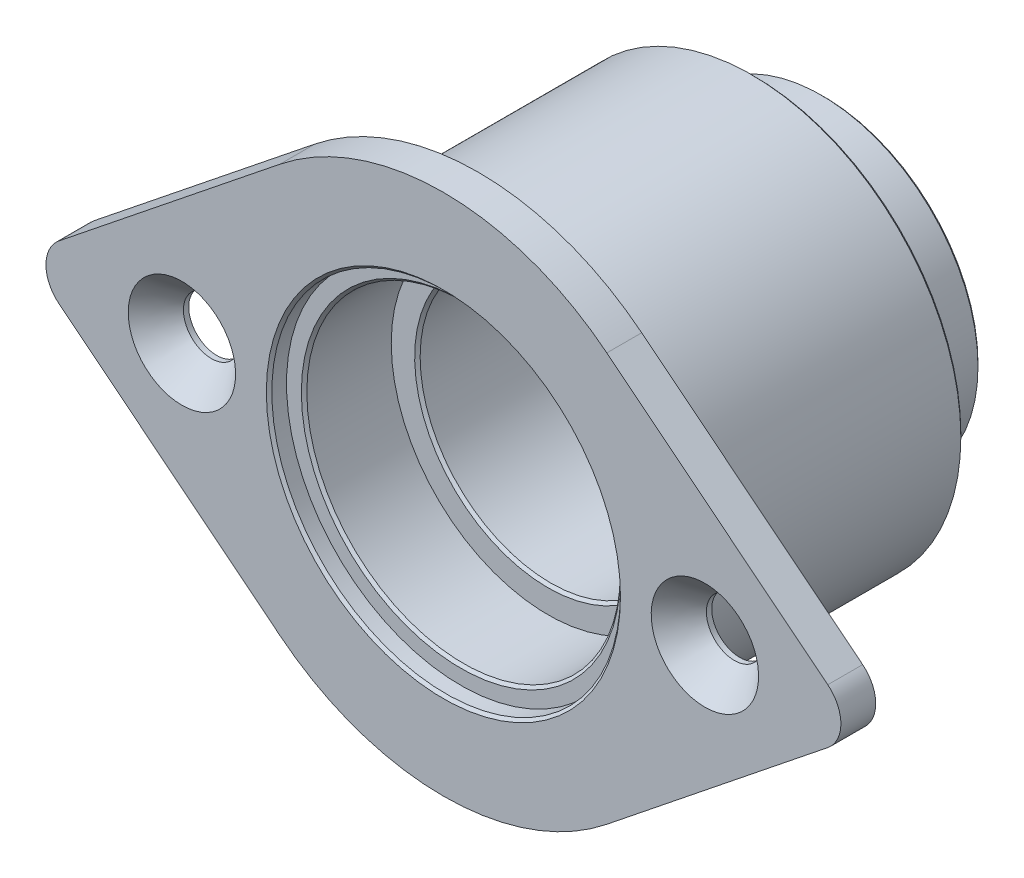
ISO-10303-21;
HEADER;
FILE_DESCRIPTION(('STEP AP214'),'2;1');
FILE_NAME('part.step','',(''),(''),'','','');
FILE_SCHEMA(('AUTOMOTIVE_DESIGN { 1 0 10303 214 1 1 1 1 }'));
ENDSEC;
DATA;
#1=APPLICATION_CONTEXT('core data for automotive mechanical design processes');
#2=APPLICATION_PROTOCOL_DEFINITION('international standard','automotive_design',2000,#1);
#3=PRODUCT_CONTEXT('',#1,'mechanical');
#4=PRODUCT('Part','Part','',(#3));
#5=PRODUCT_RELATED_PRODUCT_CATEGORY('part','',(#4));
#6=PRODUCT_DEFINITION_FORMATION('','',#4);
#7=PRODUCT_DEFINITION_CONTEXT('part definition',#1,'design');
#8=PRODUCT_DEFINITION('design','',#6,#7);
#9=PRODUCT_DEFINITION_SHAPE('','',#8);
#10=(LENGTH_UNIT() NAMED_UNIT(*) SI_UNIT(.MILLI.,.METRE.));
#11=(NAMED_UNIT(*) PLANE_ANGLE_UNIT() SI_UNIT($,.RADIAN.));
#12=(NAMED_UNIT(*) SI_UNIT($,.STERADIAN.) SOLID_ANGLE_UNIT());
#13=UNCERTAINTY_MEASURE_WITH_UNIT(LENGTH_MEASURE(1.E-05),#10,'distance_accuracy_value','');
#14=(GEOMETRIC_REPRESENTATION_CONTEXT(3) GLOBAL_UNCERTAINTY_ASSIGNED_CONTEXT((#13)) GLOBAL_UNIT_ASSIGNED_CONTEXT((#10,
#11,#12)) REPRESENTATION_CONTEXT('',''));
#15=CARTESIAN_POINT('',(0.,0.,0.));
#16=DIRECTION('',(0.,0.,1.));
#17=DIRECTION('',(1.,0.,0.));
#18=AXIS2_PLACEMENT_3D('',#15,#16,#17);
#19=CARTESIAN_POINT('',(0.,0.,-7.9375));
#20=DIRECTION('',(0.,0.,1.));
#21=DIRECTION('',(1.,0.,0.));
#22=AXIS2_PLACEMENT_3D('',#19,#20,#21);
#23=PLANE('',#22);
#24=CARTESIAN_POINT('',(0.,0.,-7.9375));
#25=DIRECTION('',(0.,0.,-1.));
#26=DIRECTION('',(-1.,0.,0.));
#27=AXIS2_PLACEMENT_3D('',#24,#25,#26);
#28=CIRCLE('',#27,14.2748);
#29=CARTESIAN_POINT('',(-14.2748,0.,-7.9375));
#30=VERTEX_POINT('',#29);
#31=EDGE_CURVE('E135',#30,#30,#28,.F.);
#32=ORIENTED_EDGE('',*,*,#31,.T.);
#33=EDGE_LOOP('',(#32));
#34=FACE_BOUND('',#33,.T.);
#35=CARTESIAN_POINT('',(0.,0.,-7.9375));
#36=DIRECTION('',(0.,0.,1.));
#37=DIRECTION('',(0.,-1.,0.));
#38=AXIS2_PLACEMENT_3D('',#35,#36,#37);
#39=CIRCLE('',#38,12.1435499999999);
#40=CARTESIAN_POINT('',(0.,-12.1435499999999,-7.9375));
#41=VERTEX_POINT('',#40);
#42=EDGE_CURVE('E19',#41,#41,#39,.F.);
#43=ORIENTED_EDGE('',*,*,#42,.T.);
#44=EDGE_LOOP('',(#43));
#45=FACE_BOUND('',#44,.T.);
#46=ADVANCED_FACE('F16',(#34,#45),#23,.T.);
#47=CARTESIAN_POINT('',(0.,0.,-7.9375));
#48=DIRECTION('',(0.,0.,1.));
#49=DIRECTION('',(0.,-1.,0.));
#50=AXIS2_PLACEMENT_3D('',#47,#48,#49);
#51=CONICAL_SURFACE('',#50,12.1435499999999,0.785398163397434);
#52=CARTESIAN_POINT('',(0.,0.,-8.18749999999995));
#53=DIRECTION('',(0.,0.,-1.));
#54=DIRECTION('',(-1.,0.,0.));
#55=AXIS2_PLACEMENT_3D('',#52,#53,#54);
#56=CIRCLE('',#55,11.89355);
#57=CARTESIAN_POINT('',(-11.89355,0.,-8.18749999999995));
#58=VERTEX_POINT('',#57);
#59=EDGE_CURVE('E133',#58,#58,#56,.T.);
#60=ORIENTED_EDGE('',*,*,#59,.T.);
#61=EDGE_LOOP('',(#60));
#62=FACE_BOUND('',#61,.T.);
#63=ORIENTED_EDGE('',*,*,#42,.F.);
#64=EDGE_LOOP('',(#63));
#65=FACE_BOUND('',#64,.T.);
#66=ADVANCED_FACE('F194',(#62,#65),#51,.F.);
#67=CARTESIAN_POINT('',(0.,0.,1.5875));
#68=DIRECTION('',(0.,0.,-1.));
#69=DIRECTION('',(-1.,0.,0.));
#70=AXIS2_PLACEMENT_3D('',#67,#68,#69);
#71=CYLINDRICAL_SURFACE('',#70,14.2748);
#72=CARTESIAN_POINT('',(0.,0.,-0.249999999999985));
#73=DIRECTION('',(0.,0.,1.));
#74=DIRECTION('',(1.,0.,0.));
#75=AXIS2_PLACEMENT_3D('',#72,#73,#74);
#76=CIRCLE('',#75,14.2748);
#77=CARTESIAN_POINT('',(14.2748,0.,-0.249999999999985));
#78=VERTEX_POINT('',#77);
#79=EDGE_CURVE('E130',#78,#78,#76,.T.);
#80=ORIENTED_EDGE('',*,*,#79,.T.);
#81=EDGE_LOOP('',(#80));
#82=FACE_BOUND('',#81,.T.);
#83=ORIENTED_EDGE('',*,*,#31,.F.);
#84=EDGE_LOOP('',(#83));
#85=FACE_BOUND('',#84,.T.);
#86=ADVANCED_FACE('F196',(#82,#85),#71,.F.);
#87=CARTESIAN_POINT('',(0.,0.,38.7877315203269));
#88=DIRECTION('',(0.,0.,-1.));
#89=DIRECTION('',(-1.,0.,0.));
#90=AXIS2_PLACEMENT_3D('',#87,#88,#89);
#91=CYLINDRICAL_SURFACE('',#90,11.89355);
#92=ORIENTED_EDGE('',*,*,#59,.F.);
#93=EDGE_LOOP('',(#92));
#94=FACE_BOUND('',#93,.T.);
#95=CARTESIAN_POINT('',(0.,0.,-32.8334999999999));
#96=DIRECTION('',(0.,0.,-1.));
#97=DIRECTION('',(-1.,0.,0.));
#98=AXIS2_PLACEMENT_3D('',#95,#96,#97);
#99=CIRCLE('',#98,11.89355);
#100=CARTESIAN_POINT('',(-11.89355,0.,-32.8334999999999));
#101=VERTEX_POINT('',#100);
#102=EDGE_CURVE('E126',#101,#101,#99,.T.);
#103=ORIENTED_EDGE('',*,*,#102,.T.);
#104=EDGE_LOOP('',(#103));
#105=FACE_BOUND('',#104,.T.);
#106=ADVANCED_FACE('F203',(#94,#105),#91,.F.);
#107=CARTESIAN_POINT('',(0.,0.,0.));
#108=DIRECTION('',(0.,0.,1.));
#109=DIRECTION('',(1.,0.,0.));
#110=AXIS2_PLACEMENT_3D('',#107,#108,#109);
#111=CONICAL_SURFACE('',#110,14.5248,0.785398163397459);
#112=ORIENTED_EDGE('',*,*,#79,.F.);
#113=EDGE_LOOP('',(#112));
#114=FACE_BOUND('',#113,.T.);
#115=CARTESIAN_POINT('',(0.,0.,0.));
#116=DIRECTION('',(0.,0.,1.));
#117=DIRECTION('',(1.,0.,0.));
#118=AXIS2_PLACEMENT_3D('',#115,#116,#117);
#119=CIRCLE('',#118,14.5248);
#120=CARTESIAN_POINT('',(14.5248,0.,0.));
#121=VERTEX_POINT('',#120);
#122=EDGE_CURVE('E129',#121,#121,#119,.F.);
#123=ORIENTED_EDGE('',*,*,#122,.F.);
#124=EDGE_LOOP('',(#123));
#125=FACE_BOUND('',#124,.T.);
#126=ADVANCED_FACE('F299',(#114,#125),#111,.F.);
#127=CARTESIAN_POINT('',(0.,0.,-33.0835));
#128=DIRECTION('',(0.,0.,-1.));
#129=DIRECTION('',(0.,1.,0.));
#130=AXIS2_PLACEMENT_3D('',#127,#128,#129);
#131=CONICAL_SURFACE('',#130,12.1435500000001,0.785398163397448);
#132=ORIENTED_EDGE('',*,*,#102,.F.);
#133=EDGE_LOOP('',(#132));
#134=FACE_BOUND('',#133,.T.);
#135=CARTESIAN_POINT('',(0.,0.,-33.0835));
#136=DIRECTION('',(0.,0.,-1.));
#137=DIRECTION('',(0.,1.,0.));
#138=AXIS2_PLACEMENT_3D('',#135,#136,#137);
#139=CIRCLE('',#138,12.1435500000001);
#140=CARTESIAN_POINT('',(0.,12.1435500000001,-33.0835));
#141=VERTEX_POINT('',#140);
#142=EDGE_CURVE('E183',#141,#141,#139,.F.);
#143=ORIENTED_EDGE('',*,*,#142,.F.);
#144=EDGE_LOOP('',(#143));
#145=FACE_BOUND('',#144,.T.);
#146=ADVANCED_FACE('F295',(#134,#145),#131,.F.);
#147=CARTESIAN_POINT('',(0.,0.,0.));
#148=DIRECTION('',(0.,0.,1.));
#149=DIRECTION('',(1.,0.,0.));
#150=AXIS2_PLACEMENT_3D('',#147,#148,#149);
#151=PLANE('',#150);
#152=CARTESIAN_POINT('',(0.,0.,0.));
#153=DIRECTION('',(0.,0.,1.));
#154=DIRECTION('',(1.,0.,0.));
#155=AXIS2_PLACEMENT_3D('',#152,#153,#154);
#156=CIRCLE('',#155,15.875);
#157=CARTESIAN_POINT('',(15.875,0.,0.));
#158=VERTEX_POINT('',#157);
#159=EDGE_CURVE('E180',#158,#158,#156,.T.);
#160=ORIENTED_EDGE('',*,*,#159,.T.);
#161=EDGE_LOOP('',(#160));
#162=FACE_BOUND('',#161,.T.);
#163=ORIENTED_EDGE('',*,*,#122,.T.);
#164=EDGE_LOOP('',(#163));
#165=FACE_BOUND('',#164,.T.);
#166=ADVANCED_FACE('F291',(#162,#165),#151,.T.);
#167=CARTESIAN_POINT('',(0.,0.,-33.0835));
#168=DIRECTION('',(0.,0.,-1.));
#169=DIRECTION('',(-1.,0.,0.));
#170=AXIS2_PLACEMENT_3D('',#167,#168,#169);
#171=PLANE('',#170);
#172=ORIENTED_EDGE('',*,*,#142,.T.);
#173=EDGE_LOOP('',(#172));
#174=FACE_BOUND('',#173,.T.);
#175=CARTESIAN_POINT('',(0.,0.,-33.0835));
#176=DIRECTION('',(0.,0.,1.));
#177=DIRECTION('',(1.,0.,0.));
#178=AXIS2_PLACEMENT_3D('',#175,#176,#177);
#179=CIRCLE('',#178,14.0121);
#180=CARTESIAN_POINT('',(14.0121,0.,-33.0835));
#181=VERTEX_POINT('',#180);
#182=EDGE_CURVE('E125',#181,#181,#179,.T.);
#183=ORIENTED_EDGE('',*,*,#182,.F.);
#184=EDGE_LOOP('',(#183));
#185=FACE_BOUND('',#184,.T.);
#186=ADVANCED_FACE('F287',(#174,#185),#171,.T.);
#187=CARTESIAN_POINT('',(0.,0.,0.));
#188=DIRECTION('',(0.,0.,1.));
#189=DIRECTION('',(1.,0.,0.));
#190=AXIS2_PLACEMENT_3D('',#187,#188,#189);
#191=CYLINDRICAL_SURFACE('',#190,15.875);
#192=ORIENTED_EDGE('',*,*,#159,.F.);
#193=EDGE_LOOP('',(#192));
#194=FACE_BOUND('',#193,.T.);
#195=CARTESIAN_POINT('',(0.,0.,1.3375));
#196=DIRECTION('',(0.,0.,1.));
#197=DIRECTION('',(1.,0.,0.));
#198=AXIS2_PLACEMENT_3D('',#195,#196,#197);
#199=CIRCLE('',#198,15.875);
#200=CARTESIAN_POINT('',(15.875,0.,1.3375));
#201=VERTEX_POINT('',#200);
#202=EDGE_CURVE('E122',#201,#201,#199,.T.);
#203=ORIENTED_EDGE('',*,*,#202,.T.);
#204=EDGE_LOOP('',(#203));
#205=FACE_BOUND('',#204,.T.);
#206=ADVANCED_FACE('F283',(#194,#205),#191,.F.);
#207=CARTESIAN_POINT('',(0.,0.,-32.8335));
#208=DIRECTION('',(0.,0.,1.));
#209=DIRECTION('',(1.,0.,0.));
#210=AXIS2_PLACEMENT_3D('',#207,#208,#209);
#211=CONICAL_SURFACE('',#210,14.2621,0.785398163397424);
#212=CARTESIAN_POINT('',(0.,0.,-32.8335));
#213=DIRECTION('',(0.,0.,-1.));
#214=DIRECTION('',(-1.,0.,0.));
#215=AXIS2_PLACEMENT_3D('',#212,#213,#214);
#216=CIRCLE('',#215,14.2621);
#217=CARTESIAN_POINT('',(-14.2621,0.,-32.8335));
#218=VERTEX_POINT('',#217);
#219=EDGE_CURVE('E118',#218,#218,#216,.F.);
#220=ORIENTED_EDGE('',*,*,#219,.F.);
#221=EDGE_LOOP('',(#220));
#222=FACE_BOUND('',#221,.T.);
#223=ORIENTED_EDGE('',*,*,#182,.T.);
#224=EDGE_LOOP('',(#223));
#225=FACE_BOUND('',#224,.T.);
#226=ADVANCED_FACE('F279',(#222,#225),#211,.T.);
#227=CARTESIAN_POINT('',(0.,0.,1.5875));
#228=DIRECTION('',(0.,0.,1.));
#229=DIRECTION('',(1.,0.,0.));
#230=AXIS2_PLACEMENT_3D('',#227,#228,#229);
#231=CONICAL_SURFACE('',#230,16.125,0.785398163397476);
#232=ORIENTED_EDGE('',*,*,#202,.F.);
#233=EDGE_LOOP('',(#232));
#234=FACE_BOUND('',#233,.T.);
#235=CARTESIAN_POINT('',(0.,0.,1.5875));
#236=DIRECTION('',(0.,0.,1.));
#237=DIRECTION('',(1.,0.,0.));
#238=AXIS2_PLACEMENT_3D('',#235,#236,#237);
#239=CIRCLE('',#238,16.125);
#240=CARTESIAN_POINT('',(16.125,0.,1.5875));
#241=VERTEX_POINT('',#240);
#242=EDGE_CURVE('E121',#241,#241,#239,.F.);
#243=ORIENTED_EDGE('',*,*,#242,.F.);
#244=EDGE_LOOP('',(#243));
#245=FACE_BOUND('',#244,.T.);
#246=ADVANCED_FACE('F275',(#234,#245),#231,.F.);
#247=CARTESIAN_POINT('',(0.,0.,27.1480367264149));
#248=DIRECTION('',(0.,0.,-1.));
#249=DIRECTION('',(-1.,0.,0.));
#250=AXIS2_PLACEMENT_3D('',#247,#248,#249);
#251=CYLINDRICAL_SURFACE('',#250,14.2621);
#252=ORIENTED_EDGE('',*,*,#219,.T.);
#253=EDGE_LOOP('',(#252));
#254=FACE_BOUND('',#253,.T.);
#255=CARTESIAN_POINT('',(0.,0.,-26.7335));
#256=DIRECTION('',(0.,0.,-1.));
#257=DIRECTION('',(-1.,0.,0.));
#258=AXIS2_PLACEMENT_3D('',#255,#256,#257);
#259=CIRCLE('',#258,14.2621);
#260=CARTESIAN_POINT('',(-14.2621,0.,-26.7335));
#261=VERTEX_POINT('',#260);
#262=EDGE_CURVE('E117',#261,#261,#259,.F.);
#263=ORIENTED_EDGE('',*,*,#262,.F.);
#264=EDGE_LOOP('',(#263));
#265=FACE_BOUND('',#264,.T.);
#266=ADVANCED_FACE('F271',(#254,#265),#251,.T.);
#267=CARTESIAN_POINT('',(-23.8125,0.,1.58749999997099));
#268=DIRECTION('',(0.,0.,1.));
#269=DIRECTION('',(0.,-1.,0.));
#270=AXIS2_PLACEMENT_3D('',#267,#268,#269);
#271=CONICAL_SURFACE('',#270,4.88949999997067,0.71558499333661);
#272=CARTESIAN_POINT('',(-23.8125,0.,-1.10068089399406));
#273=DIRECTION('',(0.,0.,1.));
#274=DIRECTION('',(1.,0.,0.));
#275=AXIS2_PLACEMENT_3D('',#272,#273,#274);
#276=CIRCLE('',#275,2.5527);
#277=CARTESIAN_POINT('',(-21.2598,0.,-1.10068089399406));
#278=VERTEX_POINT('',#277);
#279=EDGE_CURVE('E114',#278,#278,#276,.F.);
#280=ORIENTED_EDGE('',*,*,#279,.T.);
#281=EDGE_LOOP('',(#280));
#282=FACE_BOUND('',#281,.T.);
#283=CARTESIAN_POINT('',(-23.8125,0.,1.58749999997099));
#284=DIRECTION('',(0.,0.,1.));
#285=DIRECTION('',(0.,-1.,0.));
#286=AXIS2_PLACEMENT_3D('',#283,#284,#285);
#287=CIRCLE('',#286,4.88949999997067);
#288=CARTESIAN_POINT('',(-23.8125,-4.88949999997067,1.58749999997099));
#289=VERTEX_POINT('',#288);
#290=EDGE_CURVE('E173',#289,#289,#287,.F.);
#291=ORIENTED_EDGE('',*,*,#290,.F.);
#292=EDGE_LOOP('',(#291));
#293=FACE_BOUND('',#292,.T.);
#294=ADVANCED_FACE('F267',(#282,#293),#271,.F.);
#295=CARTESIAN_POINT('',(23.8125,0.,1.58749999997099));
#296=DIRECTION('',(0.,0.,1.));
#297=DIRECTION('',(0.,-1.,0.));
#298=AXIS2_PLACEMENT_3D('',#295,#296,#297);
#299=CONICAL_SURFACE('',#298,4.88949999995293,0.71558499333661);
#300=CARTESIAN_POINT('',(23.8125,0.,-1.10068089399406));
#301=DIRECTION('',(0.,0.,1.));
#302=DIRECTION('',(1.,0.,0.));
#303=AXIS2_PLACEMENT_3D('',#300,#301,#302);
#304=CIRCLE('',#303,2.5527);
#305=CARTESIAN_POINT('',(26.3652,0.,-1.10068089399406));
#306=VERTEX_POINT('',#305);
#307=EDGE_CURVE('E92',#306,#306,#304,.F.);
#308=ORIENTED_EDGE('',*,*,#307,.T.);
#309=EDGE_LOOP('',(#308));
#310=FACE_BOUND('',#309,.T.);
#311=CARTESIAN_POINT('',(23.8125,0.,1.58749999997099));
#312=DIRECTION('',(0.,0.,1.));
#313=DIRECTION('',(0.,-1.,0.));
#314=AXIS2_PLACEMENT_3D('',#311,#312,#313);
#315=CIRCLE('',#314,4.88949999995293);
#316=CARTESIAN_POINT('',(23.8125,-4.88949999995292,1.58749999997099));
#317=VERTEX_POINT('',#316);
#318=EDGE_CURVE('E170',#317,#317,#315,.F.);
#319=ORIENTED_EDGE('',*,*,#318,.F.);
#320=EDGE_LOOP('',(#319));
#321=FACE_BOUND('',#320,.T.);
#322=ADVANCED_FACE('F264',(#310,#321),#299,.F.);
#323=CARTESIAN_POINT('',(0.,0.,1.5875));
#324=DIRECTION('',(0.,0.,1.));
#325=DIRECTION('',(1.,0.,0.));
#326=AXIS2_PLACEMENT_3D('',#323,#324,#325);
#327=PLANE('',#326);
#328=DIRECTION('',(-0.7806247497998,0.625,0.));
#329=VECTOR('',#328,1.);
#330=CARTESIAN_POINT('',(-14.8828125,-18.5886268546077,1.5875));
#331=LINE('',#330,#329);
#332=CARTESIAN_POINT('',(-35.004375,-2.47848358061436,1.5875));
#333=VERTEX_POINT('',#332);
#334=CARTESIAN_POINT('',(-14.8828125,-18.5886268546077,1.5875));
#335=VERTEX_POINT('',#334);
#336=EDGE_CURVE('E110',#333,#335,#331,.F.);
#337=ORIENTED_EDGE('',*,*,#336,.T.);
#338=CARTESIAN_POINT('',(0.,0.,1.5875));
#339=DIRECTION('',(0.,0.,-1.));
#340=DIRECTION('',(-1.,0.,0.));
#341=AXIS2_PLACEMENT_3D('',#338,#339,#340);
#342=CIRCLE('',#341,23.8125);
#343=CARTESIAN_POINT('',(14.8828125,-18.5886268546077,1.5875));
#344=VERTEX_POINT('',#343);
#345=EDGE_CURVE('E162',#344,#335,#342,.T.);
#346=ORIENTED_EDGE('',*,*,#345,.F.);
#347=DIRECTION('',(0.7806247497998,0.625,0.));
#348=VECTOR('',#347,1.);
#349=CARTESIAN_POINT('',(14.8828125,-18.5886268546077,1.5875));
#350=LINE('',#349,#348);
#351=CARTESIAN_POINT('',(35.004375,-2.47848358061437,1.5875));
#352=VERTEX_POINT('',#351);
#353=EDGE_CURVE('E526',#352,#344,#350,.F.);
#354=ORIENTED_EDGE('',*,*,#353,.F.);
#355=CARTESIAN_POINT('',(33.02,0.,1.5875));
#356=DIRECTION('',(0.,0.,-1.));
#357=DIRECTION('',(-1.,0.,0.));
#358=AXIS2_PLACEMENT_3D('',#355,#356,#357);
#359=CIRCLE('',#358,3.175);
#360=CARTESIAN_POINT('',(35.004375,2.47848358061436,1.5875));
#361=VERTEX_POINT('',#360);
#362=EDGE_CURVE('E157',#361,#352,#359,.T.);
#363=ORIENTED_EDGE('',*,*,#362,.F.);
#364=DIRECTION('',(-0.7806247497998,0.625,0.));
#365=VECTOR('',#364,1.);
#366=CARTESIAN_POINT('',(14.8828125,18.5886268546077,1.5875));
#367=LINE('',#366,#365);
#368=CARTESIAN_POINT('',(14.8828125,18.5886268546077,1.5875));
#369=VERTEX_POINT('',#368);
#370=EDGE_CURVE('E88',#369,#361,#367,.F.);
#371=ORIENTED_EDGE('',*,*,#370,.F.);
#372=CARTESIAN_POINT('',(0.,0.,1.5875));
#373=DIRECTION('',(0.,0.,-1.));
#374=DIRECTION('',(-1.,0.,0.));
#375=AXIS2_PLACEMENT_3D('',#372,#373,#374);
#376=CIRCLE('',#375,23.8125);
#377=CARTESIAN_POINT('',(-14.8828125,18.5886268546077,1.5875));
#378=VERTEX_POINT('',#377);
#379=EDGE_CURVE('E80',#378,#369,#376,.T.);
#380=ORIENTED_EDGE('',*,*,#379,.F.);
#381=DIRECTION('',(0.7806247497998,0.625,0.));
#382=VECTOR('',#381,1.);
#383=CARTESIAN_POINT('',(-14.8828125,18.5886268546077,1.5875));
#384=LINE('',#383,#382);
#385=CARTESIAN_POINT('',(-35.004375,2.47848358061436,1.5875));
#386=VERTEX_POINT('',#385);
#387=EDGE_CURVE('E85',#378,#386,#384,.F.);
#388=ORIENTED_EDGE('',*,*,#387,.T.);
#389=CARTESIAN_POINT('',(-33.02,0.,1.5875));
#390=DIRECTION('',(0.,0.,-1.));
#391=DIRECTION('',(-1.,0.,0.));
#392=AXIS2_PLACEMENT_3D('',#389,#390,#391);
#393=CIRCLE('',#392,3.175);
#394=EDGE_CURVE('E106',#333,#386,#393,.T.);
#395=ORIENTED_EDGE('',*,*,#394,.F.);
#396=EDGE_LOOP('',(#337,#346,#354,#363,#371,#380,#388,#395));
#397=FACE_BOUND('',#396,.T.);
#398=ORIENTED_EDGE('',*,*,#318,.T.);
#399=EDGE_LOOP('',(#398));
#400=FACE_BOUND('',#399,.T.);
#401=ORIENTED_EDGE('',*,*,#290,.T.);
#402=EDGE_LOOP('',(#401));
#403=FACE_BOUND('',#402,.T.);
#404=ORIENTED_EDGE('',*,*,#242,.T.);
#405=EDGE_LOOP('',(#404));
#406=FACE_BOUND('',#405,.T.);
#407=ADVANCED_FACE('F82',(#397,#400,#403,#406),#327,.T.);
#408=CARTESIAN_POINT('',(0.,0.,-26.7335));
#409=DIRECTION('',(0.,0.,-1.));
#410=DIRECTION('',(-1.,0.,0.));
#411=AXIS2_PLACEMENT_3D('',#408,#409,#410);
#412=PLANE('',#411);
#413=ORIENTED_EDGE('',*,*,#262,.T.);
#414=EDGE_LOOP('',(#413));
#415=FACE_BOUND('',#414,.T.);
#416=CARTESIAN_POINT('',(0.,0.,-26.7335));
#417=DIRECTION('',(0.,0.,1.));
#418=DIRECTION('',(1.,0.,0.));
#419=AXIS2_PLACEMENT_3D('',#416,#417,#418);
#420=CIRCLE('',#419,18.8);
#421=CARTESIAN_POINT('',(18.8,0.,-26.7335));
#422=VERTEX_POINT('',#421);
#423=EDGE_CURVE('E153',#422,#422,#420,.T.);
#424=ORIENTED_EDGE('',*,*,#423,.F.);
#425=EDGE_LOOP('',(#424));
#426=FACE_BOUND('',#425,.T.);
#427=ADVANCED_FACE('F257',(#415,#426),#412,.T.);
#428=CARTESIAN_POINT('',(-23.8125,0.,1.5875));
#429=DIRECTION('',(0.,0.,1.));
#430=DIRECTION('',(1.,0.,0.));
#431=AXIS2_PLACEMENT_3D('',#428,#429,#430);
#432=CYLINDRICAL_SURFACE('',#431,2.5527);
#433=CARTESIAN_POINT('',(-23.8125,0.,-1.5875));
#434=DIRECTION('',(0.,0.,1.));
#435=DIRECTION('',(1.,0.,0.));
#436=AXIS2_PLACEMENT_3D('',#433,#434,#435);
#437=CIRCLE('',#436,2.5527);
#438=CARTESIAN_POINT('',(-21.2598,0.,-1.5875));
#439=VERTEX_POINT('',#438);
#440=EDGE_CURVE('E150',#439,#439,#437,.F.);
#441=ORIENTED_EDGE('',*,*,#440,.T.);
#442=EDGE_LOOP('',(#441));
#443=FACE_BOUND('',#442,.T.);
#444=ORIENTED_EDGE('',*,*,#279,.F.);
#445=EDGE_LOOP('',(#444));
#446=FACE_BOUND('',#445,.T.);
#447=ADVANCED_FACE('F253',(#443,#446),#432,.F.);
#448=CARTESIAN_POINT('',(23.8125,0.,1.5875));
#449=DIRECTION('',(0.,0.,1.));
#450=DIRECTION('',(1.,0.,0.));
#451=AXIS2_PLACEMENT_3D('',#448,#449,#450);
#452=CYLINDRICAL_SURFACE('',#451,2.5527);
#453=CARTESIAN_POINT('',(23.8125,0.,-1.5875));
#454=DIRECTION('',(0.,0.,1.));
#455=DIRECTION('',(1.,0.,0.));
#456=AXIS2_PLACEMENT_3D('',#453,#454,#455);
#457=CIRCLE('',#456,2.5527);
#458=CARTESIAN_POINT('',(26.3652,0.,-1.5875));
#459=VERTEX_POINT('',#458);
#460=EDGE_CURVE('E147',#459,#459,#457,.F.);
#461=ORIENTED_EDGE('',*,*,#460,.T.);
#462=EDGE_LOOP('',(#461));
#463=FACE_BOUND('',#462,.T.);
#464=ORIENTED_EDGE('',*,*,#307,.F.);
#465=EDGE_LOOP('',(#464));
#466=FACE_BOUND('',#465,.T.);
#467=ADVANCED_FACE('F250',(#463,#466),#452,.F.);
#468=CARTESIAN_POINT('',(0.,0.,1.5875));
#469=DIRECTION('',(0.,0.,-1.));
#470=DIRECTION('',(-1.,0.,0.));
#471=AXIS2_PLACEMENT_3D('',#468,#469,#470);
#472=CYLINDRICAL_SURFACE('',#471,23.8125);
#473=ORIENTED_EDGE('',*,*,#379,.T.);
#474=DIRECTION('',(0.,0.,1.));
#475=VECTOR('',#474,1.);
#476=CARTESIAN_POINT('',(14.8828125,18.5886268546077,1.5875));
#477=LINE('',#476,#475);
#478=CARTESIAN_POINT('',(14.8828125,18.5886268546077,-1.5875));
#479=VERTEX_POINT('',#478);
#480=EDGE_CURVE('E156',#479,#369,#477,.T.);
#481=ORIENTED_EDGE('',*,*,#480,.F.);
#482=CARTESIAN_POINT('',(0.,0.,-1.5875));
#483=DIRECTION('',(0.,0.,-1.));
#484=DIRECTION('',(-1.,0.,0.));
#485=AXIS2_PLACEMENT_3D('',#482,#483,#484);
#486=CIRCLE('',#485,23.8125);
#487=CARTESIAN_POINT('',(-14.8828125,18.5886268546077,-1.5875));
#488=VERTEX_POINT('',#487);
#489=EDGE_CURVE('E97',#479,#488,#486,.F.);
#490=ORIENTED_EDGE('',*,*,#489,.T.);
#491=DIRECTION('',(0.,0.,1.));
#492=VECTOR('',#491,1.);
#493=CARTESIAN_POINT('',(-14.8828125,18.5886268546077,1.5875));
#494=LINE('',#493,#492);
#495=EDGE_CURVE('E91',#488,#378,#494,.T.);
#496=ORIENTED_EDGE('',*,*,#495,.T.);
#497=EDGE_LOOP('',(#473,#481,#490,#496));
#498=FACE_BOUND('',#497,.T.);
#499=ADVANCED_FACE('F95',(#498),#472,.T.);
#500=CARTESIAN_POINT('',(-14.8828125,18.5886268546077,1.5875));
#501=DIRECTION('',(0.625,-0.7806247497998,0.));
#502=DIRECTION('',(0.7806247497998,0.625,0.));
#503=AXIS2_PLACEMENT_3D('',#500,#501,#502);
#504=PLANE('',#503);
#505=DIRECTION('',(0.,0.,-1.));
#506=VECTOR('',#505,1.);
#507=CARTESIAN_POINT('',(-35.004375,2.47848358061435,1.5875));
#508=LINE('',#507,#506);
#509=CARTESIAN_POINT('',(-35.004375,2.47848358061436,-1.5875));
#510=VERTEX_POINT('',#509);
#511=EDGE_CURVE('E104',#386,#510,#508,.T.);
#512=ORIENTED_EDGE('',*,*,#511,.F.);
#513=ORIENTED_EDGE('',*,*,#387,.F.);
#514=ORIENTED_EDGE('',*,*,#495,.F.);
#515=DIRECTION('',(-0.7806247497998,-0.625,0.));
#516=VECTOR('',#515,1.);
#517=CARTESIAN_POINT('',(-14.8828125,18.5886268546077,-1.5875));
#518=LINE('',#517,#516);
#519=EDGE_CURVE('E145',#488,#510,#518,.T.);
#520=ORIENTED_EDGE('',*,*,#519,.T.);
#521=EDGE_LOOP('',(#512,#513,#514,#520));
#522=FACE_BOUND('',#521,.T.);
#523=ADVANCED_FACE('F102',(#522),#504,.F.);
#524=CARTESIAN_POINT('',(-33.02,0.,1.5875));
#525=DIRECTION('',(0.,0.,-1.));
#526=DIRECTION('',(-1.,0.,0.));
#527=AXIS2_PLACEMENT_3D('',#524,#525,#526);
#528=CYLINDRICAL_SURFACE('',#527,3.175);
#529=CARTESIAN_POINT('',(-33.02,0.,-1.5875));
#530=DIRECTION('',(0.,0.,-1.));
#531=DIRECTION('',(-1.,0.,0.));
#532=AXIS2_PLACEMENT_3D('',#529,#530,#531);
#533=CIRCLE('',#532,3.175);
#534=CARTESIAN_POINT('',(-35.004375,-2.47848358061437,-1.5875));
#535=VERTEX_POINT('',#534);
#536=EDGE_CURVE('E143',#510,#535,#533,.F.);
#537=ORIENTED_EDGE('',*,*,#536,.T.);
#538=DIRECTION('',(0.,0.,1.));
#539=VECTOR('',#538,1.);
#540=CARTESIAN_POINT('',(-35.004375,-2.47848358061437,1.5875));
#541=LINE('',#540,#539);
#542=EDGE_CURVE('E166',#535,#333,#541,.T.);
#543=ORIENTED_EDGE('',*,*,#542,.T.);
#544=ORIENTED_EDGE('',*,*,#394,.T.);
#545=ORIENTED_EDGE('',*,*,#511,.T.);
#546=EDGE_LOOP('',(#537,#543,#544,#545));
#547=FACE_BOUND('',#546,.T.);
#548=ADVANCED_FACE('F241',(#547),#528,.T.);
#549=CARTESIAN_POINT('',(-14.8828125,-18.5886268546077,1.5875));
#550=DIRECTION('',(0.625,0.7806247497998,0.));
#551=DIRECTION('',(-0.7806247497998,0.625,0.));
#552=AXIS2_PLACEMENT_3D('',#549,#550,#551);
#553=PLANE('',#552);
#554=ORIENTED_EDGE('',*,*,#542,.F.);
#555=DIRECTION('',(0.7806247497998,-0.625,0.));
#556=VECTOR('',#555,1.);
#557=CARTESIAN_POINT('',(-35.004375,-2.47848358061437,-1.5875));
#558=LINE('',#557,#556);
#559=CARTESIAN_POINT('',(-14.8828125,-18.5886268546077,-1.5875));
#560=VERTEX_POINT('',#559);
#561=EDGE_CURVE('E142',#535,#560,#558,.T.);
#562=ORIENTED_EDGE('',*,*,#561,.T.);
#563=DIRECTION('',(0.,0.,-1.));
#564=VECTOR('',#563,1.);
#565=CARTESIAN_POINT('',(-14.8828125,-18.5886268546077,1.5875));
#566=LINE('',#565,#564);
#567=EDGE_CURVE('E165',#335,#560,#566,.T.);
#568=ORIENTED_EDGE('',*,*,#567,.F.);
#569=ORIENTED_EDGE('',*,*,#336,.F.);
#570=EDGE_LOOP('',(#554,#562,#568,#569));
#571=FACE_BOUND('',#570,.T.);
#572=ADVANCED_FACE('F237',(#571),#553,.F.);
#573=CARTESIAN_POINT('',(0.,0.,1.5875));
#574=DIRECTION('',(0.,0.,-1.));
#575=DIRECTION('',(-1.,0.,0.));
#576=AXIS2_PLACEMENT_3D('',#573,#574,#575);
#577=CYLINDRICAL_SURFACE('',#576,23.8125);
#578=ORIENTED_EDGE('',*,*,#345,.T.);
#579=ORIENTED_EDGE('',*,*,#567,.T.);
#580=CARTESIAN_POINT('',(0.,0.,-1.5875));
#581=DIRECTION('',(0.,0.,-1.));
#582=DIRECTION('',(-1.,0.,0.));
#583=AXIS2_PLACEMENT_3D('',#580,#581,#582);
#584=CIRCLE('',#583,23.8125);
#585=CARTESIAN_POINT('',(14.8828125,-18.5886268546077,-1.5875));
#586=VERTEX_POINT('',#585);
#587=EDGE_CURVE('E140',#560,#586,#584,.F.);
#588=ORIENTED_EDGE('',*,*,#587,.T.);
#589=DIRECTION('',(0.,0.,1.));
#590=VECTOR('',#589,1.);
#591=CARTESIAN_POINT('',(14.8828125,-18.5886268546077,1.5875));
#592=LINE('',#591,#590);
#593=EDGE_CURVE('E161',#344,#586,#592,.F.);
#594=ORIENTED_EDGE('',*,*,#593,.F.);
#595=EDGE_LOOP('',(#578,#579,#588,#594));
#596=FACE_BOUND('',#595,.T.);
#597=ADVANCED_FACE('F233',(#596),#577,.T.);
#598=CARTESIAN_POINT('',(14.8828125,-18.5886268546077,1.5875));
#599=DIRECTION('',(0.625,-0.7806247497998,0.));
#600=DIRECTION('',(0.7806247497998,0.625,0.));
#601=AXIS2_PLACEMENT_3D('',#598,#599,#600);
#602=PLANE('',#601);
#603=ORIENTED_EDGE('',*,*,#353,.T.);
#604=ORIENTED_EDGE('',*,*,#593,.T.);
#605=DIRECTION('',(0.7806247497998,0.625,0.));
#606=VECTOR('',#605,1.);
#607=CARTESIAN_POINT('',(14.8828125,-18.5886268546077,-1.5875));
#608=LINE('',#607,#606);
#609=CARTESIAN_POINT('',(35.004375,-2.47848358061437,-1.5875));
#610=VERTEX_POINT('',#609);
#611=EDGE_CURVE('E139',#586,#610,#608,.T.);
#612=ORIENTED_EDGE('',*,*,#611,.T.);
#613=DIRECTION('',(0.,0.,-1.));
#614=VECTOR('',#613,1.);
#615=CARTESIAN_POINT('',(35.004375,-2.47848358061437,1.5875));
#616=LINE('',#615,#614);
#617=EDGE_CURVE('E160',#352,#610,#616,.T.);
#618=ORIENTED_EDGE('',*,*,#617,.F.);
#619=EDGE_LOOP('',(#603,#604,#612,#618));
#620=FACE_BOUND('',#619,.T.);
#621=ADVANCED_FACE('F230',(#620),#602,.T.);
#622=CARTESIAN_POINT('',(33.02,0.,1.5875));
#623=DIRECTION('',(0.,0.,-1.));
#624=DIRECTION('',(-1.,0.,0.));
#625=AXIS2_PLACEMENT_3D('',#622,#623,#624);
#626=CYLINDRICAL_SURFACE('',#625,3.175);
#627=CARTESIAN_POINT('',(33.02,0.,-1.5875));
#628=DIRECTION('',(0.,0.,-1.));
#629=DIRECTION('',(-1.,0.,0.));
#630=AXIS2_PLACEMENT_3D('',#627,#628,#629);
#631=CIRCLE('',#630,3.175);
#632=CARTESIAN_POINT('',(35.004375,2.47848358061436,-1.5875));
#633=VERTEX_POINT('',#632);
#634=EDGE_CURVE('E34',#610,#633,#631,.F.);
#635=ORIENTED_EDGE('',*,*,#634,.T.);
#636=DIRECTION('',(0.,0.,1.));
#637=VECTOR('',#636,1.);
#638=CARTESIAN_POINT('',(35.004375,2.47848358061436,1.5875));
#639=LINE('',#638,#637);
#640=EDGE_CURVE('E520',#361,#633,#639,.F.);
#641=ORIENTED_EDGE('',*,*,#640,.F.);
#642=ORIENTED_EDGE('',*,*,#362,.T.);
#643=ORIENTED_EDGE('',*,*,#617,.T.);
#644=EDGE_LOOP('',(#635,#641,#642,#643));
#645=FACE_BOUND('',#644,.T.);
#646=ADVANCED_FACE('F226',(#645),#626,.T.);
#647=CARTESIAN_POINT('',(14.8828125,18.5886268546077,1.5875));
#648=DIRECTION('',(0.625,0.7806247497998,0.));
#649=DIRECTION('',(-0.7806247497998,0.625,0.));
#650=AXIS2_PLACEMENT_3D('',#647,#648,#649);
#651=PLANE('',#650);
#652=DIRECTION('',(-0.7806247497998,0.625,0.));
#653=VECTOR('',#652,1.);
#654=CARTESIAN_POINT('',(35.004375,2.47848358061437,-1.5875));
#655=LINE('',#654,#653);
#656=EDGE_CURVE('E138',#633,#479,#655,.T.);
#657=ORIENTED_EDGE('',*,*,#656,.T.);
#658=ORIENTED_EDGE('',*,*,#480,.T.);
#659=ORIENTED_EDGE('',*,*,#370,.T.);
#660=ORIENTED_EDGE('',*,*,#640,.T.);
#661=EDGE_LOOP('',(#657,#658,#659,#660));
#662=FACE_BOUND('',#661,.T.);
#663=ADVANCED_FACE('F222',(#662),#651,.T.);
#664=CARTESIAN_POINT('',(0.,0.,-26.4835));
#665=DIRECTION('',(0.,0.,1.));
#666=DIRECTION('',(1.,0.,0.));
#667=AXIS2_PLACEMENT_3D('',#664,#665,#666);
#668=CONICAL_SURFACE('',#667,19.05,0.785398163397434);
#669=ORIENTED_EDGE('',*,*,#423,.T.);
#670=EDGE_LOOP('',(#669));
#671=FACE_BOUND('',#670,.T.);
#672=CARTESIAN_POINT('',(0.,0.,-26.4835));
#673=DIRECTION('',(0.,0.,1.));
#674=DIRECTION('',(1.,0.,0.));
#675=AXIS2_PLACEMENT_3D('',#672,#673,#674);
#676=CIRCLE('',#675,19.05);
#677=CARTESIAN_POINT('',(19.05,0.,-26.4835));
#678=VERTEX_POINT('',#677);
#679=EDGE_CURVE('E25',#678,#678,#676,.T.);
#680=ORIENTED_EDGE('',*,*,#679,.F.);
#681=EDGE_LOOP('',(#680));
#682=FACE_BOUND('',#681,.T.);
#683=ADVANCED_FACE('F214',(#671,#682),#668,.T.);
#684=CARTESIAN_POINT('',(0.,0.,-1.5875));
#685=DIRECTION('',(0.,0.,1.));
#686=DIRECTION('',(1.,0.,0.));
#687=AXIS2_PLACEMENT_3D('',#684,#685,#686);
#688=PLANE('',#687);
#689=CARTESIAN_POINT('',(0.,0.,-1.5875));
#690=DIRECTION('',(0.,0.,1.));
#691=DIRECTION('',(1.,0.,0.));
#692=AXIS2_PLACEMENT_3D('',#689,#690,#691);
#693=CIRCLE('',#692,19.05);
#694=CARTESIAN_POINT('',(19.05,0.,-1.5875));
#695=VERTEX_POINT('',#694);
#696=EDGE_CURVE('E11',#695,#695,#693,.F.);
#697=ORIENTED_EDGE('',*,*,#696,.F.);
#698=EDGE_LOOP('',(#697));
#699=FACE_BOUND('',#698,.T.);
#700=ORIENTED_EDGE('',*,*,#634,.F.);
#701=ORIENTED_EDGE('',*,*,#611,.F.);
#702=ORIENTED_EDGE('',*,*,#587,.F.);
#703=ORIENTED_EDGE('',*,*,#561,.F.);
#704=ORIENTED_EDGE('',*,*,#536,.F.);
#705=ORIENTED_EDGE('',*,*,#519,.F.);
#706=ORIENTED_EDGE('',*,*,#489,.F.);
#707=ORIENTED_EDGE('',*,*,#656,.F.);
#708=EDGE_LOOP('',(#700,#701,#702,#703,#704,#705,#706,#707));
#709=FACE_BOUND('',#708,.T.);
#710=ORIENTED_EDGE('',*,*,#460,.F.);
#711=EDGE_LOOP('',(#710));
#712=FACE_BOUND('',#711,.T.);
#713=ORIENTED_EDGE('',*,*,#440,.F.);
#714=EDGE_LOOP('',(#713));
#715=FACE_BOUND('',#714,.T.);
#716=ADVANCED_FACE('F208',(#699,#709,#712,#715),#688,.F.);
#717=CARTESIAN_POINT('',(0.,0.,-26.7335));
#718=DIRECTION('',(0.,0.,1.));
#719=DIRECTION('',(1.,0.,0.));
#720=AXIS2_PLACEMENT_3D('',#717,#718,#719);
#721=CYLINDRICAL_SURFACE('',#720,19.05);
#722=ORIENTED_EDGE('',*,*,#679,.T.);
#723=EDGE_LOOP('',(#722));
#724=FACE_BOUND('',#723,.T.);
#725=ORIENTED_EDGE('',*,*,#696,.T.);
#726=EDGE_LOOP('',(#725));
#727=FACE_BOUND('',#726,.T.);
#728=ADVANCED_FACE('F206',(#724,#727),#721,.T.);
#729=CLOSED_SHELL('',(#46,#66,#86,#106,#126,#146,#166,#186,#206,#226,#246,#266,#294,#322,#407,
#427,#447,#467,#499,#523,#548,#572,#597,#621,#646,#663,#683,#716,#728));
#730=MANIFOLD_SOLID_BREP('B1',#729);
#731=ADVANCED_BREP_SHAPE_REPRESENTATION('',(#18,#730),#14);
#732=SHAPE_DEFINITION_REPRESENTATION(#9,#731);
ENDSEC;
END-ISO-10303-21;
